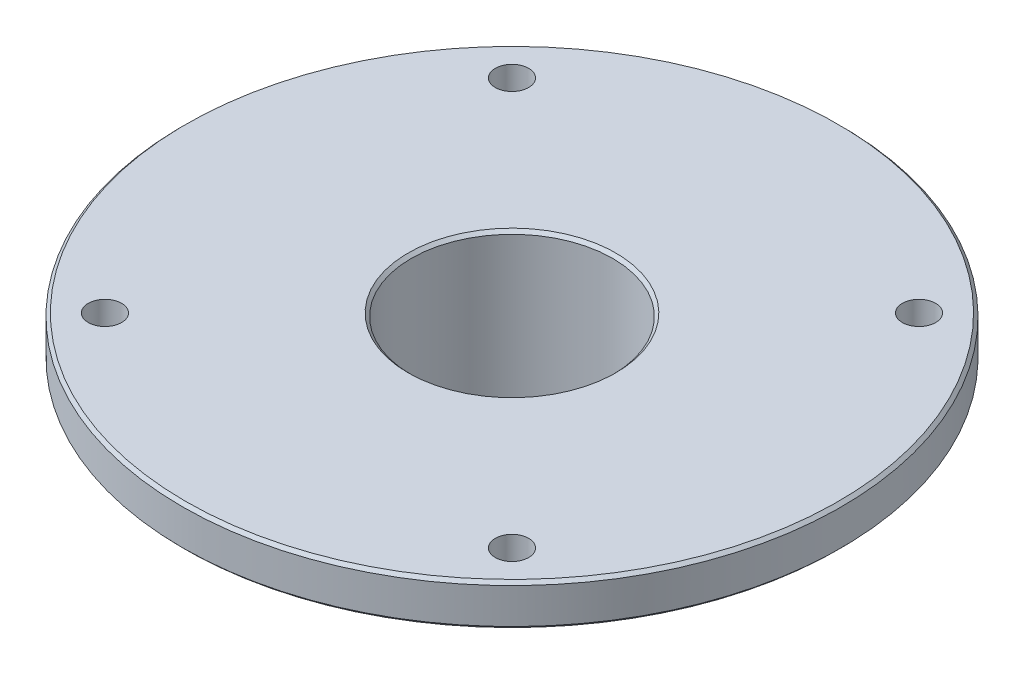
ISO-10303-21;
HEADER;
FILE_DESCRIPTION(('STEP AP214'),'2;1');
FILE_NAME('part.step','',(''),(''),'','','');
FILE_SCHEMA(('AUTOMOTIVE_DESIGN { 1 0 10303 214 1 1 1 1 }'));
ENDSEC;
DATA;
#1=APPLICATION_CONTEXT('core data for automotive mechanical design processes');
#2=APPLICATION_PROTOCOL_DEFINITION('international standard','automotive_design',2000,#1);
#3=PRODUCT_CONTEXT('',#1,'mechanical');
#4=PRODUCT('Part','Part','',(#3));
#5=PRODUCT_RELATED_PRODUCT_CATEGORY('part','',(#4));
#6=PRODUCT_DEFINITION_FORMATION('','',#4);
#7=PRODUCT_DEFINITION_CONTEXT('part definition',#1,'design');
#8=PRODUCT_DEFINITION('design','',#6,#7);
#9=PRODUCT_DEFINITION_SHAPE('','',#8);
#10=(LENGTH_UNIT() NAMED_UNIT(*) SI_UNIT(.MILLI.,.METRE.));
#11=(NAMED_UNIT(*) PLANE_ANGLE_UNIT() SI_UNIT($,.RADIAN.));
#12=(NAMED_UNIT(*) SI_UNIT($,.STERADIAN.) SOLID_ANGLE_UNIT());
#13=UNCERTAINTY_MEASURE_WITH_UNIT(LENGTH_MEASURE(1.E-05),#10,'distance_accuracy_value','');
#14=(GEOMETRIC_REPRESENTATION_CONTEXT(3) GLOBAL_UNCERTAINTY_ASSIGNED_CONTEXT((#13)) GLOBAL_UNIT_ASSIGNED_CONTEXT((#10,
#11,#12)) REPRESENTATION_CONTEXT('',''));
#15=CARTESIAN_POINT('',(0.,0.,0.));
#16=DIRECTION('',(0.,0.,1.));
#17=DIRECTION('',(1.,0.,0.));
#18=AXIS2_PLACEMENT_3D('',#15,#16,#17);
#19=CARTESIAN_POINT('',(-79.,5.51925601413886,0.));
#20=DIRECTION('',(0.,1.,0.));
#21=DIRECTION('',(0.,0.,1.));
#22=AXIS2_PLACEMENT_3D('',#19,#20,#21);
#23=PLANE('',#22);
#24=CARTESIAN_POINT('',(0.,5.51925601413886,0.));
#25=DIRECTION('',(0.,1.,0.));
#26=DIRECTION('',(0.,0.,1.));
#27=AXIS2_PLACEMENT_3D('',#24,#25,#26);
#28=CIRCLE('',#27,24.9000000000001);
#29=CARTESIAN_POINT('',(0.,5.51925601413886,24.9000000000001));
#30=VERTEX_POINT('',#29);
#31=EDGE_CURVE('E52',#30,#30,#28,.F.);
#32=ORIENTED_EDGE('',*,*,#31,.T.);
#33=EDGE_LOOP('',(#32));
#34=FACE_BOUND('',#33,.T.);
#35=CARTESIAN_POINT('',(0.,5.51925601413886,0.));
#36=DIRECTION('',(0.,1.,0.));
#37=DIRECTION('',(0.,0.,1.));
#38=AXIS2_PLACEMENT_3D('',#35,#36,#37);
#39=CIRCLE('',#38,78.25);
#40=CARTESIAN_POINT('',(0.,5.51925601413886,78.25));
#41=VERTEX_POINT('',#40);
#42=EDGE_CURVE('E55',#41,#41,#39,.T.);
#43=ORIENTED_EDGE('',*,*,#42,.T.);
#44=EDGE_LOOP('',(#43));
#45=FACE_BOUND('',#44,.T.);
#46=CARTESIAN_POINT('',(-48.7903679018718,5.51925601413886,-48.7903679018718));
#47=DIRECTION('',(0.,1.,0.));
#48=DIRECTION('',(0.,0.,1.));
#49=AXIS2_PLACEMENT_3D('',#46,#47,#48);
#50=CIRCLE('',#49,4.);
#51=CARTESIAN_POINT('',(-48.7903679018718,5.51925601413886,-44.7903679018718));
#52=VERTEX_POINT('',#51);
#53=EDGE_CURVE('E89',#52,#52,#50,.T.);
#54=ORIENTED_EDGE('',*,*,#53,.F.);
#55=EDGE_LOOP('',(#54));
#56=FACE_BOUND('',#55,.T.);
#57=CARTESIAN_POINT('',(-48.7903679018718,5.51925601413886,48.7903679018718));
#58=DIRECTION('',(0.,1.,0.));
#59=DIRECTION('',(0.,0.,1.));
#60=AXIS2_PLACEMENT_3D('',#57,#58,#59);
#61=CIRCLE('',#60,4.);
#62=CARTESIAN_POINT('',(-48.7903679018718,5.51925601413886,52.7903679018718));
#63=VERTEX_POINT('',#62);
#64=EDGE_CURVE('E95',#63,#63,#61,.T.);
#65=ORIENTED_EDGE('',*,*,#64,.F.);
#66=EDGE_LOOP('',(#65));
#67=FACE_BOUND('',#66,.T.);
#68=CARTESIAN_POINT('',(48.7903679018718,5.51925601413886,48.7903679018718));
#69=DIRECTION('',(0.,1.,0.));
#70=DIRECTION('',(0.,0.,1.));
#71=AXIS2_PLACEMENT_3D('',#68,#69,#70);
#72=CIRCLE('',#71,4.);
#73=CARTESIAN_POINT('',(48.7903679018718,5.51925601413886,52.7903679018718));
#74=VERTEX_POINT('',#73);
#75=EDGE_CURVE('E83',#74,#74,#72,.T.);
#76=ORIENTED_EDGE('',*,*,#75,.F.);
#77=EDGE_LOOP('',(#76));
#78=FACE_BOUND('',#77,.T.);
#79=CARTESIAN_POINT('',(48.7903679018718,5.51925601413886,-48.7903679018718));
#80=DIRECTION('',(0.,1.,0.));
#81=DIRECTION('',(0.,0.,1.));
#82=AXIS2_PLACEMENT_3D('',#79,#80,#81);
#83=CIRCLE('',#82,4.);
#84=CARTESIAN_POINT('',(48.7903679018718,5.51925601413886,-44.7903679018718));
#85=VERTEX_POINT('',#84);
#86=EDGE_CURVE('E79',#85,#85,#83,.T.);
#87=ORIENTED_EDGE('',*,*,#86,.F.);
#88=EDGE_LOOP('',(#87));
#89=FACE_BOUND('',#88,.T.);
#90=ADVANCED_FACE('F32',(#34,#45,#56,#67,#78,#89),#23,.T.);
#91=CARTESIAN_POINT('',(0.,0.,0.));
#92=DIRECTION('',(0.,1.,0.));
#93=DIRECTION('',(0.,0.,1.));
#94=AXIS2_PLACEMENT_3D('',#91,#92,#93);
#95=CYLINDRICAL_SURFACE('',#94,24.15);
#96=CARTESIAN_POINT('',(0.,-33.7307439858611,0.));
#97=DIRECTION('',(0.,-1.,0.));
#98=DIRECTION('',(0.,0.,-1.));
#99=AXIS2_PLACEMENT_3D('',#96,#97,#98);
#100=CIRCLE('',#99,24.15);
#101=CARTESIAN_POINT('',(0.,-33.7307439858611,-24.15));
#102=VERTEX_POINT('',#101);
#103=EDGE_CURVE('E58',#102,#102,#100,.T.);
#104=ORIENTED_EDGE('',*,*,#103,.T.);
#105=EDGE_LOOP('',(#104));
#106=FACE_BOUND('',#105,.T.);
#107=CARTESIAN_POINT('',(0.,4.76925601413879,0.));
#108=DIRECTION('',(0.,1.,0.));
#109=DIRECTION('',(0.,0.,1.));
#110=AXIS2_PLACEMENT_3D('',#107,#108,#109);
#111=CIRCLE('',#110,24.15);
#112=CARTESIAN_POINT('',(0.,4.76925601413879,24.15));
#113=VERTEX_POINT('',#112);
#114=EDGE_CURVE('E61',#113,#113,#111,.T.);
#115=ORIENTED_EDGE('',*,*,#114,.T.);
#116=EDGE_LOOP('',(#115));
#117=FACE_BOUND('',#116,.T.);
#118=ADVANCED_FACE('F108',(#106,#117),#95,.F.);
#119=CARTESIAN_POINT('',(-24.15,-34.4807439858611,0.));
#120=DIRECTION('',(0.,-1.,0.));
#121=DIRECTION('',(0.,0.,-1.));
#122=AXIS2_PLACEMENT_3D('',#119,#120,#121);
#123=PLANE('',#122);
#124=CARTESIAN_POINT('',(0.,-34.4807439858611,0.));
#125=DIRECTION('',(0.,-1.,0.));
#126=DIRECTION('',(0.,0.,-1.));
#127=AXIS2_PLACEMENT_3D('',#124,#125,#126);
#128=CIRCLE('',#127,24.9);
#129=CARTESIAN_POINT('',(0.,-34.4807439858611,-24.9));
#130=VERTEX_POINT('',#129);
#131=EDGE_CURVE('E64',#130,#130,#128,.F.);
#132=ORIENTED_EDGE('',*,*,#131,.T.);
#133=EDGE_LOOP('',(#132));
#134=FACE_BOUND('',#133,.T.);
#135=CARTESIAN_POINT('',(0.,-34.4807439858611,0.));
#136=DIRECTION('',(0.,-1.,0.));
#137=DIRECTION('',(0.,0.,-1.));
#138=AXIS2_PLACEMENT_3D('',#135,#136,#137);
#139=CIRCLE('',#138,29.25);
#140=CARTESIAN_POINT('',(0.,-34.4807439858611,-29.25));
#141=VERTEX_POINT('',#140);
#142=EDGE_CURVE('E67',#141,#141,#139,.T.);
#143=ORIENTED_EDGE('',*,*,#142,.T.);
#144=EDGE_LOOP('',(#143));
#145=FACE_BOUND('',#144,.T.);
#146=ADVANCED_FACE('F145',(#134,#145),#123,.T.);
#147=CARTESIAN_POINT('',(0.,0.,0.));
#148=DIRECTION('',(0.,1.,0.));
#149=DIRECTION('',(0.,0.,1.));
#150=AXIS2_PLACEMENT_3D('',#147,#148,#149);
#151=CYLINDRICAL_SURFACE('',#150,30.);
#152=CARTESIAN_POINT('',(0.,-33.7307439858611,0.));
#153=DIRECTION('',(0.,-1.,0.));
#154=DIRECTION('',(0.,0.,-1.));
#155=AXIS2_PLACEMENT_3D('',#152,#153,#154);
#156=CIRCLE('',#155,30.);
#157=CARTESIAN_POINT('',(0.,-33.7307439858611,-30.));
#158=VERTEX_POINT('',#157);
#159=EDGE_CURVE('E47',#158,#158,#156,.F.);
#160=ORIENTED_EDGE('',*,*,#159,.T.);
#161=EDGE_LOOP('',(#160));
#162=FACE_BOUND('',#161,.T.);
#163=CARTESIAN_POINT('',(0.,-6.48074398586113,0.));
#164=DIRECTION('',(0.,1.,0.));
#165=DIRECTION('',(0.,0.,1.));
#166=AXIS2_PLACEMENT_3D('',#163,#164,#165);
#167=CIRCLE('',#166,30.);
#168=CARTESIAN_POINT('',(0.,-6.48074398586113,30.));
#169=VERTEX_POINT('',#168);
#170=EDGE_CURVE('E70',#169,#169,#167,.T.);
#171=ORIENTED_EDGE('',*,*,#170,.F.);
#172=EDGE_LOOP('',(#171));
#173=FACE_BOUND('',#172,.T.);
#174=ADVANCED_FACE('F141',(#162,#173),#151,.T.);
#175=CARTESIAN_POINT('',(-30.,-6.48074398586113,0.));
#176=DIRECTION('',(0.,-1.,0.));
#177=DIRECTION('',(0.,0.,-1.));
#178=AXIS2_PLACEMENT_3D('',#175,#176,#177);
#179=PLANE('',#178);
#180=ORIENTED_EDGE('',*,*,#170,.T.);
#181=EDGE_LOOP('',(#180));
#182=FACE_BOUND('',#181,.T.);
#183=CARTESIAN_POINT('',(0.,-6.48074398586113,0.));
#184=DIRECTION('',(0.,1.,0.));
#185=DIRECTION('',(0.,0.,1.));
#186=AXIS2_PLACEMENT_3D('',#183,#184,#185);
#187=CIRCLE('',#186,36.);
#188=CARTESIAN_POINT('',(0.,-6.48074398586113,36.));
#189=VERTEX_POINT('',#188);
#190=EDGE_CURVE('E73',#189,#189,#187,.T.);
#191=ORIENTED_EDGE('',*,*,#190,.F.);
#192=EDGE_LOOP('',(#191));
#193=FACE_BOUND('',#192,.T.);
#194=ADVANCED_FACE('F137',(#182,#193),#179,.T.);
#195=CARTESIAN_POINT('',(0.,0.,0.));
#196=DIRECTION('',(0.,1.,0.));
#197=DIRECTION('',(0.,0.,1.));
#198=AXIS2_PLACEMENT_3D('',#195,#196,#197);
#199=CYLINDRICAL_SURFACE('',#198,36.);
#200=ORIENTED_EDGE('',*,*,#190,.T.);
#201=EDGE_LOOP('',(#200));
#202=FACE_BOUND('',#201,.T.);
#203=CARTESIAN_POINT('',(0.,-4.48074398586113,0.));
#204=DIRECTION('',(0.,1.,0.));
#205=DIRECTION('',(0.,0.,1.));
#206=AXIS2_PLACEMENT_3D('',#203,#204,#205);
#207=CIRCLE('',#206,36.);
#208=CARTESIAN_POINT('',(0.,-4.48074398586113,36.));
#209=VERTEX_POINT('',#208);
#210=EDGE_CURVE('E76',#209,#209,#207,.T.);
#211=ORIENTED_EDGE('',*,*,#210,.F.);
#212=EDGE_LOOP('',(#211));
#213=FACE_BOUND('',#212,.T.);
#214=ADVANCED_FACE('F134',(#202,#213),#199,.T.);
#215=CARTESIAN_POINT('',(-36.,-4.48074398586114,0.));
#216=DIRECTION('',(0.,-1.,0.));
#217=DIRECTION('',(0.,0.,-1.));
#218=AXIS2_PLACEMENT_3D('',#215,#216,#217);
#219=PLANE('',#218);
#220=CARTESIAN_POINT('',(0.,-4.48074398586114,0.));
#221=DIRECTION('',(0.,-1.,0.));
#222=DIRECTION('',(0.,0.,-1.));
#223=AXIS2_PLACEMENT_3D('',#220,#221,#222);
#224=CIRCLE('',#223,78.25);
#225=CARTESIAN_POINT('',(0.,-4.48074398586114,-78.25));
#226=VERTEX_POINT('',#225);
#227=EDGE_CURVE('E10',#226,#226,#224,.T.);
#228=ORIENTED_EDGE('',*,*,#227,.T.);
#229=EDGE_LOOP('',(#228));
#230=FACE_BOUND('',#229,.T.);
#231=CARTESIAN_POINT('',(-48.7903679018718,-4.48074398586114,-48.7903679018718));
#232=DIRECTION('',(0.,-1.,0.));
#233=DIRECTION('',(0.,0.,-1.));
#234=AXIS2_PLACEMENT_3D('',#231,#232,#233);
#235=CIRCLE('',#234,4.);
#236=CARTESIAN_POINT('',(-48.7903679018718,-4.48074398586114,-52.7903679018718));
#237=VERTEX_POINT('',#236);
#238=EDGE_CURVE('E86',#237,#237,#235,.F.);
#239=ORIENTED_EDGE('',*,*,#238,.T.);
#240=EDGE_LOOP('',(#239));
#241=FACE_BOUND('',#240,.T.);
#242=CARTESIAN_POINT('',(-48.7903679018718,-4.48074398586114,48.7903679018718));
#243=DIRECTION('',(0.,-1.,0.));
#244=DIRECTION('',(0.,0.,-1.));
#245=AXIS2_PLACEMENT_3D('',#242,#243,#244);
#246=CIRCLE('',#245,4.);
#247=CARTESIAN_POINT('',(-48.7903679018718,-4.48074398586114,44.7903679018718));
#248=VERTEX_POINT('',#247);
#249=EDGE_CURVE('E92',#248,#248,#246,.F.);
#250=ORIENTED_EDGE('',*,*,#249,.T.);
#251=EDGE_LOOP('',(#250));
#252=FACE_BOUND('',#251,.T.);
#253=CARTESIAN_POINT('',(48.7903679018718,-4.48074398586114,48.7903679018718));
#254=DIRECTION('',(0.,-1.,0.));
#255=DIRECTION('',(0.,0.,-1.));
#256=AXIS2_PLACEMENT_3D('',#253,#254,#255);
#257=CIRCLE('',#256,4.);
#258=CARTESIAN_POINT('',(48.7903679018718,-4.48074398586114,44.7903679018718));
#259=VERTEX_POINT('',#258);
#260=EDGE_CURVE('E98',#259,#259,#257,.F.);
#261=ORIENTED_EDGE('',*,*,#260,.T.);
#262=EDGE_LOOP('',(#261));
#263=FACE_BOUND('',#262,.T.);
#264=CARTESIAN_POINT('',(48.7903679018718,-4.48074398586114,-48.7903679018718));
#265=DIRECTION('',(0.,-1.,0.));
#266=DIRECTION('',(0.,0.,-1.));
#267=AXIS2_PLACEMENT_3D('',#264,#265,#266);
#268=CIRCLE('',#267,4.);
#269=CARTESIAN_POINT('',(48.7903679018718,-4.48074398586114,-52.7903679018718));
#270=VERTEX_POINT('',#269);
#271=EDGE_CURVE('E80',#270,#270,#268,.F.);
#272=ORIENTED_EDGE('',*,*,#271,.T.);
#273=EDGE_LOOP('',(#272));
#274=FACE_BOUND('',#273,.T.);
#275=ORIENTED_EDGE('',*,*,#210,.T.);
#276=EDGE_LOOP('',(#275));
#277=FACE_BOUND('',#276,.T.);
#278=ADVANCED_FACE('F125',(#230,#241,#252,#263,#274,#277),#219,.T.);
#279=CARTESIAN_POINT('',(0.,0.,0.));
#280=DIRECTION('',(0.,1.,0.));
#281=DIRECTION('',(0.,0.,1.));
#282=AXIS2_PLACEMENT_3D('',#279,#280,#281);
#283=CYLINDRICAL_SURFACE('',#282,79.);
#284=CARTESIAN_POINT('',(0.,-3.73074398586116,0.));
#285=DIRECTION('',(0.,-1.,0.));
#286=DIRECTION('',(0.,0.,-1.));
#287=AXIS2_PLACEMENT_3D('',#284,#285,#286);
#288=CIRCLE('',#287,79.);
#289=CARTESIAN_POINT('',(0.,-3.73074398586116,-79.));
#290=VERTEX_POINT('',#289);
#291=EDGE_CURVE('E39',#290,#290,#288,.F.);
#292=ORIENTED_EDGE('',*,*,#291,.T.);
#293=EDGE_LOOP('',(#292));
#294=FACE_BOUND('',#293,.T.);
#295=CARTESIAN_POINT('',(0.,4.76925601413885,0.));
#296=DIRECTION('',(0.,1.,0.));
#297=DIRECTION('',(0.,0.,1.));
#298=AXIS2_PLACEMENT_3D('',#295,#296,#297);
#299=CIRCLE('',#298,79.);
#300=CARTESIAN_POINT('',(0.,4.76925601413885,79.));
#301=VERTEX_POINT('',#300);
#302=EDGE_CURVE('E43',#301,#301,#299,.F.);
#303=ORIENTED_EDGE('',*,*,#302,.T.);
#304=EDGE_LOOP('',(#303));
#305=FACE_BOUND('',#304,.T.);
#306=ADVANCED_FACE('F115',(#294,#305),#283,.T.);
#307=CARTESIAN_POINT('',(48.7903679018718,-34.4817439858611,-48.7903679018718));
#308=DIRECTION('',(0.,1.,0.));
#309=DIRECTION('',(0.,0.,1.));
#310=AXIS2_PLACEMENT_3D('',#307,#308,#309);
#311=CYLINDRICAL_SURFACE('',#310,4.);
#312=ORIENTED_EDGE('',*,*,#271,.F.);
#313=EDGE_LOOP('',(#312));
#314=FACE_BOUND('',#313,.T.);
#315=ORIENTED_EDGE('',*,*,#86,.T.);
#316=EDGE_LOOP('',(#315));
#317=FACE_BOUND('',#316,.T.);
#318=ADVANCED_FACE('F113',(#314,#317),#311,.F.);
#319=CARTESIAN_POINT('',(48.7903679018718,-34.4817439858611,48.7903679018718));
#320=DIRECTION('',(0.,1.,0.));
#321=DIRECTION('',(0.,0.,1.));
#322=AXIS2_PLACEMENT_3D('',#319,#320,#321);
#323=CYLINDRICAL_SURFACE('',#322,4.);
#324=ORIENTED_EDGE('',*,*,#260,.F.);
#325=EDGE_LOOP('',(#324));
#326=FACE_BOUND('',#325,.T.);
#327=ORIENTED_EDGE('',*,*,#75,.T.);
#328=EDGE_LOOP('',(#327));
#329=FACE_BOUND('',#328,.T.);
#330=ADVANCED_FACE('F104',(#326,#329),#323,.F.);
#331=CARTESIAN_POINT('',(-48.7903679018718,-34.4817439858611,48.7903679018718));
#332=DIRECTION('',(0.,1.,0.));
#333=DIRECTION('',(0.,0.,1.));
#334=AXIS2_PLACEMENT_3D('',#331,#332,#333);
#335=CYLINDRICAL_SURFACE('',#334,4.);
#336=ORIENTED_EDGE('',*,*,#249,.F.);
#337=EDGE_LOOP('',(#336));
#338=FACE_BOUND('',#337,.T.);
#339=ORIENTED_EDGE('',*,*,#64,.T.);
#340=EDGE_LOOP('',(#339));
#341=FACE_BOUND('',#340,.T.);
#342=ADVANCED_FACE('F122',(#338,#341),#335,.F.);
#343=CARTESIAN_POINT('',(-48.7903679018718,-34.4817439858611,-48.7903679018718));
#344=DIRECTION('',(0.,1.,0.));
#345=DIRECTION('',(0.,0.,1.));
#346=AXIS2_PLACEMENT_3D('',#343,#344,#345);
#347=CYLINDRICAL_SURFACE('',#346,4.);
#348=ORIENTED_EDGE('',*,*,#238,.F.);
#349=EDGE_LOOP('',(#348));
#350=FACE_BOUND('',#349,.T.);
#351=ORIENTED_EDGE('',*,*,#53,.T.);
#352=EDGE_LOOP('',(#351));
#353=FACE_BOUND('',#352,.T.);
#354=ADVANCED_FACE('F129',(#350,#353),#347,.F.);
#355=CARTESIAN_POINT('',(0.,-34.4807439858611,0.));
#356=DIRECTION('',(0.,-1.,0.));
#357=DIRECTION('',(0.,0.,-1.));
#358=AXIS2_PLACEMENT_3D('',#355,#356,#357);
#359=CONICAL_SURFACE('',#358,24.9,0.785398163397444);
#360=ORIENTED_EDGE('',*,*,#103,.F.);
#361=EDGE_LOOP('',(#360));
#362=FACE_BOUND('',#361,.T.);
#363=ORIENTED_EDGE('',*,*,#131,.F.);
#364=EDGE_LOOP('',(#363));
#365=FACE_BOUND('',#364,.T.);
#366=ADVANCED_FACE('F153',(#362,#365),#359,.F.);
#367=CARTESIAN_POINT('',(0.,4.76925601413879,0.));
#368=DIRECTION('',(0.,1.,0.));
#369=DIRECTION('',(0.,0.,1.));
#370=AXIS2_PLACEMENT_3D('',#367,#368,#369);
#371=CONICAL_SURFACE('',#370,24.15,0.785398163397446);
#372=ORIENTED_EDGE('',*,*,#31,.F.);
#373=EDGE_LOOP('',(#372));
#374=FACE_BOUND('',#373,.T.);
#375=ORIENTED_EDGE('',*,*,#114,.F.);
#376=EDGE_LOOP('',(#375));
#377=FACE_BOUND('',#376,.T.);
#378=ADVANCED_FACE('F156',(#374,#377),#371,.F.);
#379=CARTESIAN_POINT('',(0.,-33.7307439858611,0.));
#380=DIRECTION('',(0.,1.,0.));
#381=DIRECTION('',(0.,0.,1.));
#382=AXIS2_PLACEMENT_3D('',#379,#380,#381);
#383=CONICAL_SURFACE('',#382,30.,0.785398163397455);
#384=ORIENTED_EDGE('',*,*,#142,.F.);
#385=EDGE_LOOP('',(#384));
#386=FACE_BOUND('',#385,.T.);
#387=ORIENTED_EDGE('',*,*,#159,.F.);
#388=EDGE_LOOP('',(#387));
#389=FACE_BOUND('',#388,.T.);
#390=ADVANCED_FACE('F160',(#386,#389),#383,.T.);
#391=CARTESIAN_POINT('',(0.,-3.73074398586116,0.));
#392=DIRECTION('',(0.,1.,0.));
#393=DIRECTION('',(0.,0.,1.));
#394=AXIS2_PLACEMENT_3D('',#391,#392,#393);
#395=CONICAL_SURFACE('',#394,79.,0.785398163397457);
#396=ORIENTED_EDGE('',*,*,#227,.F.);
#397=EDGE_LOOP('',(#396));
#398=FACE_BOUND('',#397,.T.);
#399=ORIENTED_EDGE('',*,*,#291,.F.);
#400=EDGE_LOOP('',(#399));
#401=FACE_BOUND('',#400,.T.);
#402=ADVANCED_FACE('F163',(#398,#401),#395,.T.);
#403=CARTESIAN_POINT('',(0.,5.51925601413886,0.));
#404=DIRECTION('',(0.,-1.,0.));
#405=DIRECTION('',(0.,0.,-1.));
#406=AXIS2_PLACEMENT_3D('',#403,#404,#405);
#407=CONICAL_SURFACE('',#406,78.25,0.785398163397448);
#408=ORIENTED_EDGE('',*,*,#302,.F.);
#409=EDGE_LOOP('',(#408));
#410=FACE_BOUND('',#409,.T.);
#411=ORIENTED_EDGE('',*,*,#42,.F.);
#412=EDGE_LOOP('',(#411));
#413=FACE_BOUND('',#412,.T.);
#414=ADVANCED_FACE('F34',(#410,#413),#407,.T.);
#415=CLOSED_SHELL('',(#90,#118,#146,#174,#194,#214,#278,#306,#318,#330,#342,#354,#366,#378,#390,
#402,#414));
#416=MANIFOLD_SOLID_BREP('B2',#415);
#417=ADVANCED_BREP_SHAPE_REPRESENTATION('',(#18,#416),#14);
#418=SHAPE_DEFINITION_REPRESENTATION(#9,#417);
ENDSEC;
END-ISO-10303-21;
